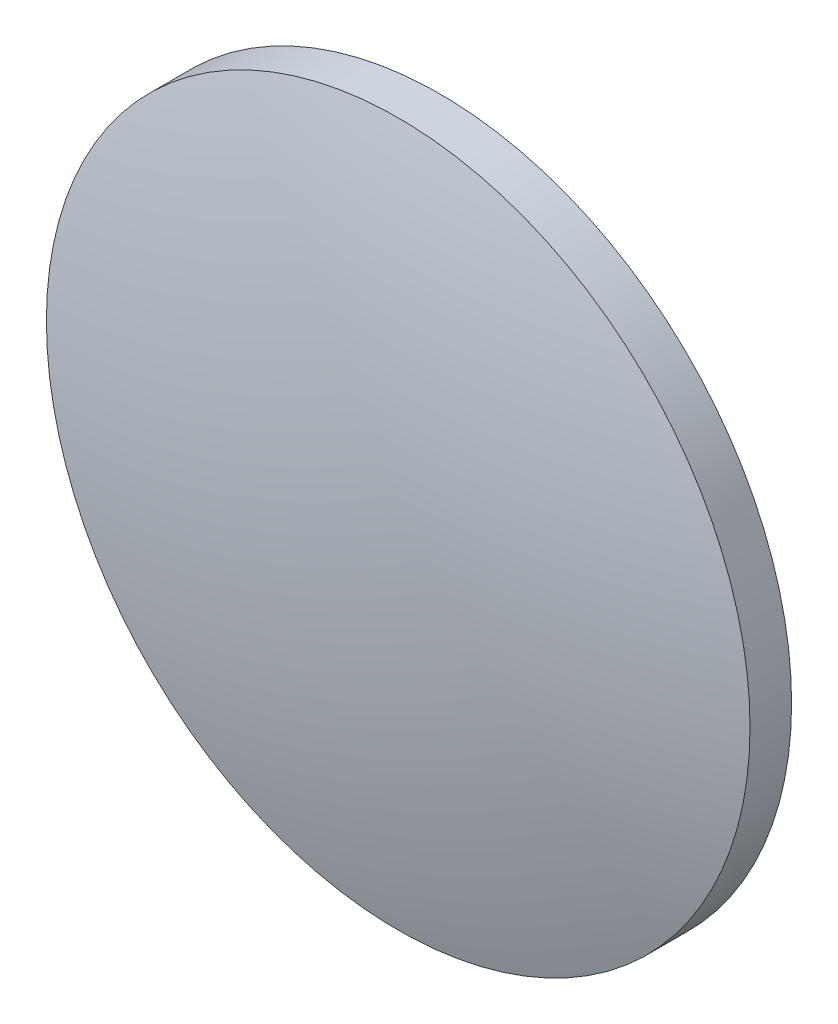
ISO-10303-21;
HEADER;
FILE_DESCRIPTION(('STEP AP214'),'2;1');
FILE_NAME('part.step','',(''),(''),'','','');
FILE_SCHEMA(('AUTOMOTIVE_DESIGN { 1 0 10303 214 1 1 1 1 }'));
ENDSEC;
DATA;
#1=APPLICATION_CONTEXT('core data for automotive mechanical design processes');
#2=APPLICATION_PROTOCOL_DEFINITION('international standard','automotive_design',2000,#1);
#3=PRODUCT_CONTEXT('',#1,'mechanical');
#4=PRODUCT('Part','Part','',(#3));
#5=PRODUCT_RELATED_PRODUCT_CATEGORY('part','',(#4));
#6=PRODUCT_DEFINITION_FORMATION('','',#4);
#7=PRODUCT_DEFINITION_CONTEXT('part definition',#1,'design');
#8=PRODUCT_DEFINITION('design','',#6,#7);
#9=PRODUCT_DEFINITION_SHAPE('','',#8);
#10=(LENGTH_UNIT() NAMED_UNIT(*) SI_UNIT(.MILLI.,.METRE.));
#11=(NAMED_UNIT(*) PLANE_ANGLE_UNIT() SI_UNIT($,.RADIAN.));
#12=(NAMED_UNIT(*) SI_UNIT($,.STERADIAN.) SOLID_ANGLE_UNIT());
#13=UNCERTAINTY_MEASURE_WITH_UNIT(LENGTH_MEASURE(1.E-05),#10,'distance_accuracy_value','');
#14=(GEOMETRIC_REPRESENTATION_CONTEXT(3) GLOBAL_UNCERTAINTY_ASSIGNED_CONTEXT((#13)) GLOBAL_UNIT_ASSIGNED_CONTEXT((#10,
#11,#12)) REPRESENTATION_CONTEXT('',''));
#15=CARTESIAN_POINT('',(0.,0.,0.));
#16=DIRECTION('',(0.,0.,1.));
#17=DIRECTION('',(1.,0.,0.));
#18=AXIS2_PLACEMENT_3D('',#15,#16,#17);
#19=CARTESIAN_POINT('',(-0.0174564595410223,0.,-88.7299983442296));
#20=DIRECTION('',(0.,-1.,0.));
#21=DIRECTION('',(1.,0.,0.));
#22=AXIS2_PLACEMENT_3D('',#19,#20,#21);
#23=CIRCLE('',#22,92.02);
#24=TRIMMED_CURVE('',#23,(PARAMETER_VALUE(-1.57060662390807)),
(PARAMETER_VALUE(1.57060662390807)),.T.,.PARAMETER.);
#25=CARTESIAN_POINT('',(0.,0.,-88.7299983442296));
#26=DIRECTION('',(0.,0.,1.));
#27=AXIS1_PLACEMENT('',#25,#26);
#28=SURFACE_OF_REVOLUTION('',#24,#27);
#29=CARTESIAN_POINT('',(0.,0.,3.29));
#30=VERTEX_POINT('',#29);
#31=VERTEX_LOOP('',#30);
#32=FACE_BOUND('',#31,.T.);
#33=CARTESIAN_POINT('',(0.,0.,-0.29));
#34=DIRECTION('',(0.,0.,1.));
#35=DIRECTION('',(1.,0.,0.));
#36=AXIS2_PLACEMENT_3D('',#33,#34,#35);
#37=CIRCLE('',#36,25.4);
#38=CARTESIAN_POINT('',(25.4,0.,-0.29));
#39=VERTEX_POINT('',#38);
#40=EDGE_CURVE('E21',#39,#39,#37,.T.);
#41=ORIENTED_EDGE('',*,*,#40,.T.);
#42=EDGE_LOOP('',(#41));
#43=FACE_BOUND('',#42,.T.);
#44=ADVANCED_FACE('F15',(#32,#43),#28,.T.);
#45=CARTESIAN_POINT('',(0.,0.,-3.29));
#46=DIRECTION('',(0.,0.,1.));
#47=DIRECTION('',(1.,0.,0.));
#48=AXIS2_PLACEMENT_3D('',#45,#46,#47);
#49=PLANE('',#48);
#50=CARTESIAN_POINT('',(0.,0.,-3.29));
#51=DIRECTION('',(0.,0.,1.));
#52=DIRECTION('',(1.,0.,0.));
#53=AXIS2_PLACEMENT_3D('',#50,#51,#52);
#54=CIRCLE('',#53,25.4);
#55=CARTESIAN_POINT('',(25.4,0.,-3.29));
#56=VERTEX_POINT('',#55);
#57=EDGE_CURVE('E10',#56,#56,#54,.T.);
#58=ORIENTED_EDGE('',*,*,#57,.F.);
#59=EDGE_LOOP('',(#58));
#60=FACE_BOUND('',#59,.T.);
#61=ADVANCED_FACE('F26',(#60),#49,.F.);
#62=CARTESIAN_POINT('',(0.,0.,14.0974031194487));
#63=DIRECTION('',(0.,0.,1.));
#64=DIRECTION('',(1.,0.,0.));
#65=AXIS2_PLACEMENT_3D('',#62,#63,#64);
#66=CYLINDRICAL_SURFACE('',#65,25.4);
#67=ORIENTED_EDGE('',*,*,#40,.F.);
#68=EDGE_LOOP('',(#67));
#69=FACE_BOUND('',#68,.T.);
#70=ORIENTED_EDGE('',*,*,#57,.T.);
#71=EDGE_LOOP('',(#70));
#72=FACE_BOUND('',#71,.T.);
#73=ADVANCED_FACE('F30',(#69,#72),#66,.T.);
#74=CLOSED_SHELL('',(#44,#61,#73));
#75=MANIFOLD_SOLID_BREP('B1',#74);
#76=ADVANCED_BREP_SHAPE_REPRESENTATION('',(#18,#75),#14);
#77=SHAPE_DEFINITION_REPRESENTATION(#9,#76);
ENDSEC;
END-ISO-10303-21;
